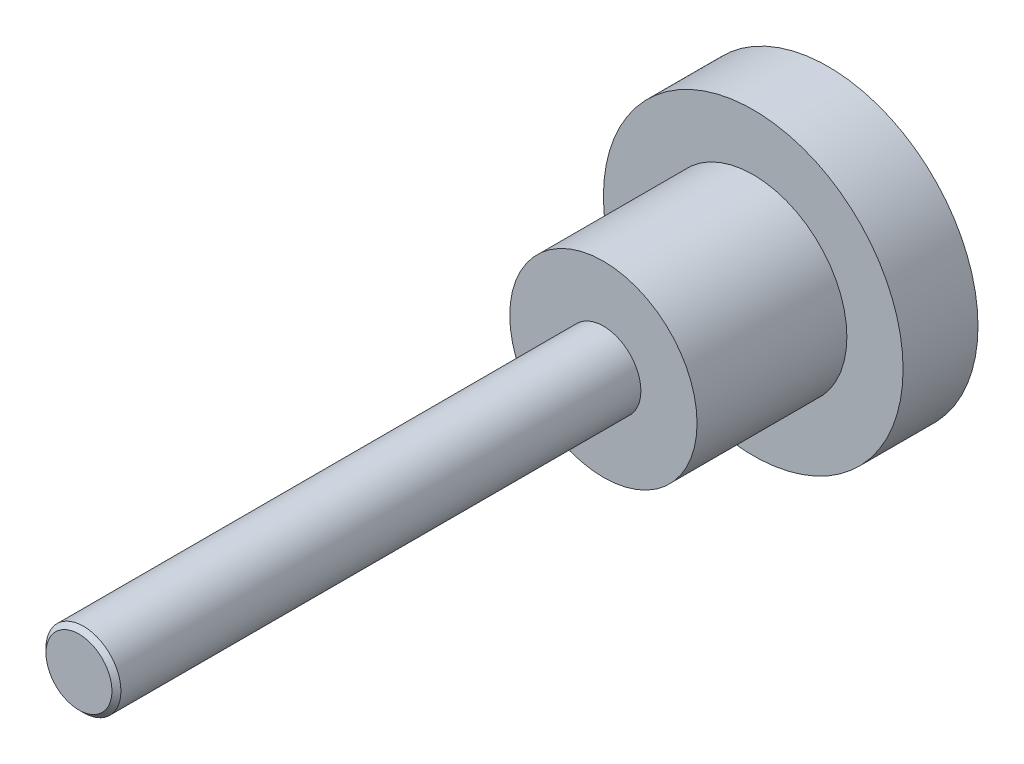
ISO-10303-21;
HEADER;
FILE_DESCRIPTION(('STEP AP214'),'2;1');
FILE_NAME('part.step','',(''),(''),'','','');
FILE_SCHEMA(('AUTOMOTIVE_DESIGN { 1 0 10303 214 1 1 1 1 }'));
ENDSEC;
DATA;
#1=APPLICATION_CONTEXT('core data for automotive mechanical design processes');
#2=APPLICATION_PROTOCOL_DEFINITION('international standard','automotive_design',2000,#1);
#3=PRODUCT_CONTEXT('',#1,'mechanical');
#4=PRODUCT('Part','Part','',(#3));
#5=PRODUCT_RELATED_PRODUCT_CATEGORY('part','',(#4));
#6=PRODUCT_DEFINITION_FORMATION('','',#4);
#7=PRODUCT_DEFINITION_CONTEXT('part definition',#1,'design');
#8=PRODUCT_DEFINITION('design','',#6,#7);
#9=PRODUCT_DEFINITION_SHAPE('','',#8);
#10=(LENGTH_UNIT() NAMED_UNIT(*) SI_UNIT(.MILLI.,.METRE.));
#11=(NAMED_UNIT(*) PLANE_ANGLE_UNIT() SI_UNIT($,.RADIAN.));
#12=(NAMED_UNIT(*) SI_UNIT($,.STERADIAN.) SOLID_ANGLE_UNIT());
#13=UNCERTAINTY_MEASURE_WITH_UNIT(LENGTH_MEASURE(1.E-05),#10,'distance_accuracy_value','');
#14=(GEOMETRIC_REPRESENTATION_CONTEXT(3) GLOBAL_UNCERTAINTY_ASSIGNED_CONTEXT((#13)) GLOBAL_UNIT_ASSIGNED_CONTEXT((#10,
#11,#12)) REPRESENTATION_CONTEXT('',''));
#15=CARTESIAN_POINT('',(0.,0.,0.));
#16=DIRECTION('',(0.,0.,1.));
#17=DIRECTION('',(1.,0.,0.));
#18=AXIS2_PLACEMENT_3D('',#15,#16,#17);
#19=CARTESIAN_POINT('',(-25.4185688754194,8.52359182386692,0.));
#20=DIRECTION('',(0.,0.,-1.));
#21=DIRECTION('',(-1.,0.,0.));
#22=AXIS2_PLACEMENT_3D('',#19,#20,#21);
#23=PLANE('',#22);
#24=CARTESIAN_POINT('',(-25.4185688754194,8.52359182386692,0.));
#25=DIRECTION('',(0.,0.,1.));
#26=DIRECTION('',(1.,0.,0.));
#27=AXIS2_PLACEMENT_3D('',#24,#25,#26);
#28=CIRCLE('',#27,12.7);
#29=CARTESIAN_POINT('',(-12.7185688754194,8.52359182386692,0.));
#30=VERTEX_POINT('',#29);
#31=EDGE_CURVE('E18',#30,#30,#28,.T.);
#32=ORIENTED_EDGE('',*,*,#31,.F.);
#33=EDGE_LOOP('',(#32));
#34=FACE_BOUND('',#33,.T.);
#35=ADVANCED_FACE('F15',(#34),#23,.T.);
#36=CARTESIAN_POINT('',(-25.4185688754194,8.52359182386692,0.));
#37=DIRECTION('',(0.,0.,1.));
#38=DIRECTION('',(1.,0.,0.));
#39=AXIS2_PLACEMENT_3D('',#36,#37,#38);
#40=CYLINDRICAL_SURFACE('',#39,12.7);
#41=CARTESIAN_POINT('',(-25.4185688754194,8.52359182386692,6.35));
#42=DIRECTION('',(0.,0.,1.));
#43=DIRECTION('',(1.,0.,0.));
#44=AXIS2_PLACEMENT_3D('',#41,#42,#43);
#45=CIRCLE('',#44,12.7);
#46=CARTESIAN_POINT('',(-12.7185688754194,8.52359182386692,6.35));
#47=VERTEX_POINT('',#46);
#48=EDGE_CURVE('E39',#47,#47,#45,.F.);
#49=ORIENTED_EDGE('',*,*,#48,.T.);
#50=EDGE_LOOP('',(#49));
#51=FACE_BOUND('',#50,.T.);
#52=ORIENTED_EDGE('',*,*,#31,.T.);
#53=EDGE_LOOP('',(#52));
#54=FACE_BOUND('',#53,.T.);
#55=ADVANCED_FACE('F46',(#51,#54),#40,.T.);
#56=CARTESIAN_POINT('',(-25.4185688754194,8.52359182386692,6.35));
#57=DIRECTION('',(0.,0.,-1.));
#58=DIRECTION('',(-1.,0.,0.));
#59=AXIS2_PLACEMENT_3D('',#56,#57,#58);
#60=PLANE('',#59);
#61=CARTESIAN_POINT('',(-25.4185688754194,8.52359182386692,6.35));
#62=DIRECTION('',(0.,0.,1.));
#63=DIRECTION('',(1.,0.,0.));
#64=AXIS2_PLACEMENT_3D('',#61,#62,#63);
#65=CIRCLE('',#64,7.9375);
#66=CARTESIAN_POINT('',(-17.4810688754194,8.52359182386692,6.35));
#67=VERTEX_POINT('',#66);
#68=EDGE_CURVE('E37',#67,#67,#65,.T.);
#69=ORIENTED_EDGE('',*,*,#68,.F.);
#70=EDGE_LOOP('',(#69));
#71=FACE_BOUND('',#70,.T.);
#72=ORIENTED_EDGE('',*,*,#48,.F.);
#73=EDGE_LOOP('',(#72));
#74=FACE_BOUND('',#73,.T.);
#75=ADVANCED_FACE('F53',(#71,#74),#60,.F.);
#76=CARTESIAN_POINT('',(-25.4185688754194,8.52359182386692,63.5));
#77=DIRECTION('',(0.,0.,-1.));
#78=DIRECTION('',(-1.,0.,0.));
#79=AXIS2_PLACEMENT_3D('',#76,#77,#78);
#80=PLANE('',#79);
#81=CARTESIAN_POINT('',(-25.4185688754194,8.52359182386692,63.4999999999195));
#82=DIRECTION('',(0.,0.,-1.));
#83=DIRECTION('',(-1.,0.,0.));
#84=AXIS2_PLACEMENT_3D('',#81,#82,#83);
#85=CIRCLE('',#84,2.79399999998418);
#86=CARTESIAN_POINT('',(-28.2125688754036,8.52359182386692,63.4999999999195));
#87=VERTEX_POINT('',#86);
#88=EDGE_CURVE('E34',#87,#87,#85,.T.);
#89=ORIENTED_EDGE('',*,*,#88,.F.);
#90=EDGE_LOOP('',(#89));
#91=FACE_BOUND('',#90,.T.);
#92=ADVANCED_FACE('F72',(#91),#80,.F.);
#93=CARTESIAN_POINT('',(-25.4185688754194,8.52359182386692,6.35));
#94=DIRECTION('',(0.,0.,1.));
#95=DIRECTION('',(1.,0.,0.));
#96=AXIS2_PLACEMENT_3D('',#93,#94,#95);
#97=CYLINDRICAL_SURFACE('',#96,7.9375);
#98=CARTESIAN_POINT('',(-25.4185688754194,8.52359182386692,19.05));
#99=DIRECTION('',(0.,0.,1.));
#100=DIRECTION('',(1.,0.,0.));
#101=AXIS2_PLACEMENT_3D('',#98,#99,#100);
#102=CIRCLE('',#101,7.9375);
#103=CARTESIAN_POINT('',(-17.4810688754194,8.52359182386692,19.05));
#104=VERTEX_POINT('',#103);
#105=EDGE_CURVE('E27',#104,#104,#102,.F.);
#106=ORIENTED_EDGE('',*,*,#105,.T.);
#107=EDGE_LOOP('',(#106));
#108=FACE_BOUND('',#107,.T.);
#109=ORIENTED_EDGE('',*,*,#68,.T.);
#110=EDGE_LOOP('',(#109));
#111=FACE_BOUND('',#110,.T.);
#112=ADVANCED_FACE('F68',(#108,#111),#97,.T.);
#113=CARTESIAN_POINT('',(-25.4185688754194,8.52359182386692,63.1190000000856));
#114=DIRECTION('',(0.,0.,-1.));
#115=DIRECTION('',(-1.,0.,0.));
#116=AXIS2_PLACEMENT_3D('',#113,#114,#115);
#117=CONICAL_SURFACE('',#116,3.17499999976121,0.785398163322851);
#118=ORIENTED_EDGE('',*,*,#88,.T.);
#119=EDGE_LOOP('',(#118));
#120=FACE_BOUND('',#119,.T.);
#121=CARTESIAN_POINT('',(-25.4185688754194,8.52359182386692,63.119));
#122=DIRECTION('',(0.,0.,1.));
#123=DIRECTION('',(1.,0.,0.));
#124=AXIS2_PLACEMENT_3D('',#121,#122,#123);
#125=CIRCLE('',#124,3.175);
#126=CARTESIAN_POINT('',(-22.2435688754194,8.52359182386692,63.119));
#127=VERTEX_POINT('',#126);
#128=EDGE_CURVE('E22',#127,#127,#125,.F.);
#129=ORIENTED_EDGE('',*,*,#128,.F.);
#130=EDGE_LOOP('',(#129));
#131=FACE_BOUND('',#130,.T.);
#132=ADVANCED_FACE('F61',(#120,#131),#117,.T.);
#133=CARTESIAN_POINT('',(-25.4185688754194,8.52359182386692,19.05));
#134=DIRECTION('',(0.,0.,-1.));
#135=DIRECTION('',(-1.,0.,0.));
#136=AXIS2_PLACEMENT_3D('',#133,#134,#135);
#137=PLANE('',#136);
#138=CARTESIAN_POINT('',(-25.4185688754194,8.52359182386692,19.05));
#139=DIRECTION('',(0.,0.,1.));
#140=DIRECTION('',(1.,0.,0.));
#141=AXIS2_PLACEMENT_3D('',#138,#139,#140);
#142=CIRCLE('',#141,3.175);
#143=CARTESIAN_POINT('',(-22.2435688754194,8.52359182386692,19.05));
#144=VERTEX_POINT('',#143);
#145=EDGE_CURVE('E10',#144,#144,#142,.T.);
#146=ORIENTED_EDGE('',*,*,#145,.F.);
#147=EDGE_LOOP('',(#146));
#148=FACE_BOUND('',#147,.T.);
#149=ORIENTED_EDGE('',*,*,#105,.F.);
#150=EDGE_LOOP('',(#149));
#151=FACE_BOUND('',#150,.T.);
#152=ADVANCED_FACE('F56',(#148,#151),#137,.F.);
#153=CARTESIAN_POINT('',(-25.4185688754194,8.52359182386692,19.05));
#154=DIRECTION('',(0.,0.,1.));
#155=DIRECTION('',(1.,0.,0.));
#156=AXIS2_PLACEMENT_3D('',#153,#154,#155);
#157=CYLINDRICAL_SURFACE('',#156,3.175);
#158=ORIENTED_EDGE('',*,*,#145,.T.);
#159=EDGE_LOOP('',(#158));
#160=FACE_BOUND('',#159,.T.);
#161=ORIENTED_EDGE('',*,*,#128,.T.);
#162=EDGE_LOOP('',(#161));
#163=FACE_BOUND('',#162,.T.);
#164=ADVANCED_FACE('F54',(#160,#163),#157,.T.);
#165=CLOSED_SHELL('',(#35,#55,#75,#92,#112,#132,#152,#164));
#166=MANIFOLD_SOLID_BREP('B1',#165);
#167=ADVANCED_BREP_SHAPE_REPRESENTATION('',(#18,#166),#14);
#168=SHAPE_DEFINITION_REPRESENTATION(#9,#167);
ENDSEC;
END-ISO-10303-21;
